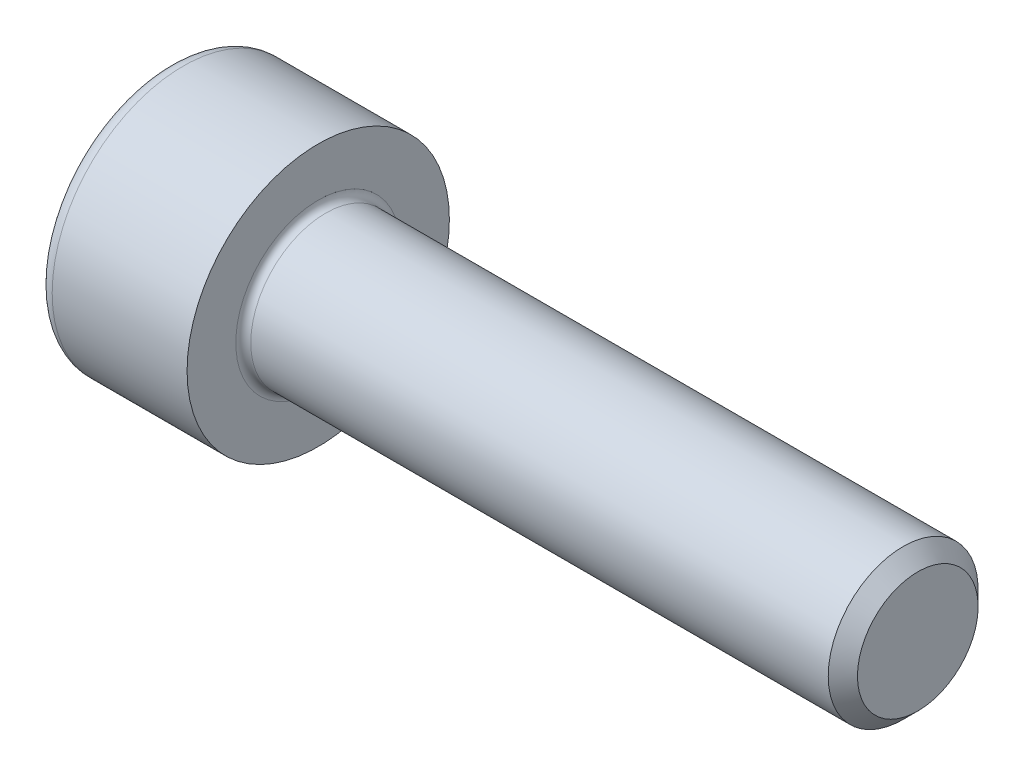
ISO-10303-21;
HEADER;
FILE_DESCRIPTION(('STEP AP214'),'2;1');
FILE_NAME('part.step','',(''),(''),'','','');
FILE_SCHEMA(('AUTOMOTIVE_DESIGN { 1 0 10303 214 1 1 1 1 }'));
ENDSEC;
DATA;
#1=APPLICATION_CONTEXT('core data for automotive mechanical design processes');
#2=APPLICATION_PROTOCOL_DEFINITION('international standard','automotive_design',2000,#1);
#3=PRODUCT_CONTEXT('',#1,'mechanical');
#4=PRODUCT('Part','Part','',(#3));
#5=PRODUCT_RELATED_PRODUCT_CATEGORY('part','',(#4));
#6=PRODUCT_DEFINITION_FORMATION('','',#4);
#7=PRODUCT_DEFINITION_CONTEXT('part definition',#1,'design');
#8=PRODUCT_DEFINITION('design','',#6,#7);
#9=PRODUCT_DEFINITION_SHAPE('','',#8);
#10=(LENGTH_UNIT() NAMED_UNIT(*) SI_UNIT(.MILLI.,.METRE.));
#11=(NAMED_UNIT(*) PLANE_ANGLE_UNIT() SI_UNIT($,.RADIAN.));
#12=(NAMED_UNIT(*) SI_UNIT($,.STERADIAN.) SOLID_ANGLE_UNIT());
#13=UNCERTAINTY_MEASURE_WITH_UNIT(LENGTH_MEASURE(1.E-05),#10,'distance_accuracy_value','');
#14=(GEOMETRIC_REPRESENTATION_CONTEXT(3) GLOBAL_UNCERTAINTY_ASSIGNED_CONTEXT((#13)) GLOBAL_UNIT_ASSIGNED_CONTEXT((#10,
#11,#12)) REPRESENTATION_CONTEXT('',''));
#15=CARTESIAN_POINT('',(0.,0.,0.));
#16=DIRECTION('',(0.,0.,1.));
#17=DIRECTION('',(1.,0.,0.));
#18=AXIS2_PLACEMENT_3D('',#15,#16,#17);
#19=CARTESIAN_POINT('',(0.,0.,0.));
#20=DIRECTION('',(-1.,0.,0.));
#21=DIRECTION('',(0.,0.,1.));
#22=AXIS2_PLACEMENT_3D('',#19,#20,#21);
#23=PLANE('',#22);
#24=DIRECTION('',(0.,-0.499999999999999,0.866025403784439));
#25=VECTOR('',#24,1.);
#26=CARTESIAN_POINT('',(0.,1.74359781295267,0.));
#27=LINE('',#26,#25);
#28=CARTESIAN_POINT('',(0.,1.74359781295267,0.));
#29=VERTEX_POINT('',#28);
#30=CARTESIAN_POINT('',(0.,0.871798906476336,1.51));
#31=VERTEX_POINT('',#30);
#32=EDGE_CURVE('E265',#29,#31,#27,.T.);
#33=ORIENTED_EDGE('',*,*,#32,.T.);
#34=DIRECTION('',(0.,1.,0.));
#35=VECTOR('',#34,1.);
#36=CARTESIAN_POINT('',(0.,-0.871798906476335,1.51));
#37=LINE('',#36,#35);
#38=CARTESIAN_POINT('',(0.,-0.871798906476335,1.51));
#39=VERTEX_POINT('',#38);
#40=EDGE_CURVE('E137',#39,#31,#37,.T.);
#41=ORIENTED_EDGE('',*,*,#40,.F.);
#42=DIRECTION('',(0.,-0.500000000000001,-0.866025403784438));
#43=VECTOR('',#42,1.);
#44=CARTESIAN_POINT('',(0.,-0.871798906476335,1.51));
#45=LINE('',#44,#43);
#46=CARTESIAN_POINT('',(0.,-1.74359781295267,0.));
#47=VERTEX_POINT('',#46);
#48=EDGE_CURVE('E268',#39,#47,#45,.T.);
#49=ORIENTED_EDGE('',*,*,#48,.T.);
#50=DIRECTION('',(0.,0.499999999999999,-0.866025403784439));
#51=VECTOR('',#50,1.);
#52=CARTESIAN_POINT('',(0.,-1.74359781295267,0.));
#53=LINE('',#52,#51);
#54=CARTESIAN_POINT('',(0.,-0.871798906476338,-1.51));
#55=VERTEX_POINT('',#54);
#56=EDGE_CURVE('E271',#47,#55,#53,.T.);
#57=ORIENTED_EDGE('',*,*,#56,.T.);
#58=DIRECTION('',(0.,-1.,0.));
#59=VECTOR('',#58,1.);
#60=CARTESIAN_POINT('',(0.,0.871798906476332,-1.51));
#61=LINE('',#60,#59);
#62=CARTESIAN_POINT('',(0.,0.871798906476332,-1.51));
#63=VERTEX_POINT('',#62);
#64=EDGE_CURVE('E274',#63,#55,#61,.T.);
#65=ORIENTED_EDGE('',*,*,#64,.F.);
#66=DIRECTION('',(0.,-0.500000000000001,-0.866025403784438));
#67=VECTOR('',#66,1.);
#68=CARTESIAN_POINT('',(0.,1.74359781295267,0.));
#69=LINE('',#68,#67);
#70=EDGE_CURVE('E132',#29,#63,#69,.T.);
#71=ORIENTED_EDGE('',*,*,#70,.F.);
#72=EDGE_LOOP('',(#33,#41,#49,#57,#65,#71));
#73=FACE_BOUND('',#72,.T.);
#74=CARTESIAN_POINT('',(0.,0.,0.));
#75=DIRECTION('',(-1.,0.,0.));
#76=DIRECTION('',(0.,0.,1.));
#77=AXIS2_PLACEMENT_3D('',#74,#75,#76);
#78=CIRCLE('',#77,3.1);
#79=CARTESIAN_POINT('',(0.,0.,3.1));
#80=VERTEX_POINT('',#79);
#81=EDGE_CURVE('E49',#80,#80,#78,.T.);
#82=ORIENTED_EDGE('',*,*,#81,.T.);
#83=EDGE_LOOP('',(#82));
#84=FACE_BOUND('',#83,.T.);
#85=ADVANCED_FACE('F41',(#73,#84),#23,.T.);
#86=CARTESIAN_POINT('',(-31.75,0.,0.));
#87=DIRECTION('',(-1.,0.,0.));
#88=DIRECTION('',(0.,0.,1.));
#89=AXIS2_PLACEMENT_3D('',#86,#87,#88);
#90=CYLINDRICAL_SURFACE('',#89,3.5);
#91=CARTESIAN_POINT('',(0.399999999999998,0.,0.));
#92=DIRECTION('',(-1.,0.,0.));
#93=DIRECTION('',(0.,0.,1.));
#94=AXIS2_PLACEMENT_3D('',#91,#92,#93);
#95=CIRCLE('',#94,3.5);
#96=CARTESIAN_POINT('',(0.399999999999998,0.,3.5));
#97=VERTEX_POINT('',#96);
#98=EDGE_CURVE('E11',#97,#97,#95,.F.);
#99=ORIENTED_EDGE('',*,*,#98,.T.);
#100=EDGE_LOOP('',(#99));
#101=FACE_BOUND('',#100,.T.);
#102=CARTESIAN_POINT('',(4.,0.,0.));
#103=DIRECTION('',(-1.,0.,0.));
#104=DIRECTION('',(0.,0.,1.));
#105=AXIS2_PLACEMENT_3D('',#102,#103,#104);
#106=CIRCLE('',#105,3.5);
#107=CARTESIAN_POINT('',(4.,0.,3.5));
#108=VERTEX_POINT('',#107);
#109=EDGE_CURVE('E155',#108,#108,#106,.T.);
#110=ORIENTED_EDGE('',*,*,#109,.T.);
#111=EDGE_LOOP('',(#110));
#112=FACE_BOUND('',#111,.T.);
#113=ADVANCED_FACE('F180',(#101,#112),#90,.T.);
#114=CARTESIAN_POINT('',(4.,3.5,0.));
#115=DIRECTION('',(1.,0.,0.));
#116=DIRECTION('',(0.,0.,-1.));
#117=AXIS2_PLACEMENT_3D('',#114,#115,#116);
#118=PLANE('',#117);
#119=CARTESIAN_POINT('',(4.,0.,0.));
#120=DIRECTION('',(1.,0.,0.));
#121=DIRECTION('',(0.,0.,-1.));
#122=AXIS2_PLACEMENT_3D('',#119,#120,#121);
#123=CIRCLE('',#122,2.2);
#124=CARTESIAN_POINT('',(4.,0.,-2.2));
#125=VERTEX_POINT('',#124);
#126=EDGE_CURVE('E158',#125,#125,#123,.F.);
#127=ORIENTED_EDGE('',*,*,#126,.T.);
#128=EDGE_LOOP('',(#127));
#129=FACE_BOUND('',#128,.T.);
#130=ORIENTED_EDGE('',*,*,#109,.F.);
#131=EDGE_LOOP('',(#130));
#132=FACE_BOUND('',#131,.T.);
#133=ADVANCED_FACE('F185',(#129,#132),#118,.T.);
#134=CARTESIAN_POINT('',(-31.75,0.,0.));
#135=DIRECTION('',(-1.,0.,0.));
#136=DIRECTION('',(0.,0.,1.));
#137=AXIS2_PLACEMENT_3D('',#134,#135,#136);
#138=CYLINDRICAL_SURFACE('',#137,2.);
#139=CARTESIAN_POINT('',(4.2,0.,0.));
#140=DIRECTION('',(1.,0.,0.));
#141=DIRECTION('',(0.,0.,-1.));
#142=AXIS2_PLACEMENT_3D('',#139,#140,#141);
#143=CIRCLE('',#142,2.);
#144=CARTESIAN_POINT('',(4.2,0.,-2.));
#145=VERTEX_POINT('',#144);
#146=EDGE_CURVE('E161',#145,#145,#143,.T.);
#147=ORIENTED_EDGE('',*,*,#146,.T.);
#148=EDGE_LOOP('',(#147));
#149=FACE_BOUND('',#148,.T.);
#150=CARTESIAN_POINT('',(19.61,0.,0.));
#151=DIRECTION('',(-1.,0.,0.));
#152=DIRECTION('',(0.,0.,1.));
#153=AXIS2_PLACEMENT_3D('',#150,#151,#152);
#154=CIRCLE('',#153,2.);
#155=CARTESIAN_POINT('',(19.61,0.,2.));
#156=VERTEX_POINT('',#155);
#157=EDGE_CURVE('E152',#156,#156,#154,.T.);
#158=ORIENTED_EDGE('',*,*,#157,.T.);
#159=EDGE_LOOP('',(#158));
#160=FACE_BOUND('',#159,.T.);
#161=ADVANCED_FACE('F191',(#149,#160),#138,.T.);
#162=CARTESIAN_POINT('',(20.,0.,0.));
#163=DIRECTION('',(-1.,0.,0.));
#164=DIRECTION('',(0.,0.,1.));
#165=AXIS2_PLACEMENT_3D('',#162,#163,#164);
#166=CONICAL_SURFACE('',#165,1.61,0.785398163397445);
#167=ORIENTED_EDGE('',*,*,#157,.F.);
#168=EDGE_LOOP('',(#167));
#169=FACE_BOUND('',#168,.T.);
#170=CARTESIAN_POINT('',(20.,0.,0.));
#171=DIRECTION('',(-1.,0.,0.));
#172=DIRECTION('',(0.,0.,1.));
#173=AXIS2_PLACEMENT_3D('',#170,#171,#172);
#174=CIRCLE('',#173,1.61);
#175=CARTESIAN_POINT('',(20.,0.,1.61));
#176=VERTEX_POINT('',#175);
#177=EDGE_CURVE('E148',#176,#176,#174,.T.);
#178=ORIENTED_EDGE('',*,*,#177,.T.);
#179=EDGE_LOOP('',(#178));
#180=FACE_BOUND('',#179,.T.);
#181=ADVANCED_FACE('F195',(#169,#180),#166,.T.);
#182=CARTESIAN_POINT('',(20.,1.61,0.));
#183=DIRECTION('',(1.,0.,0.));
#184=DIRECTION('',(0.,0.,-1.));
#185=AXIS2_PLACEMENT_3D('',#182,#183,#184);
#186=PLANE('',#185);
#187=ORIENTED_EDGE('',*,*,#177,.F.);
#188=EDGE_LOOP('',(#187));
#189=FACE_BOUND('',#188,.T.);
#190=ADVANCED_FACE('F177',(#189),#186,.T.);
#191=CARTESIAN_POINT('',(4.2,0.,0.));
#192=DIRECTION('',(1.,0.,0.));
#193=DIRECTION('',(0.,0.,-1.));
#194=AXIS2_PLACEMENT_3D('',#191,#192,#193);
#195=TOROIDAL_SURFACE('',#194,2.2,0.2);
#196=ORIENTED_EDGE('',*,*,#146,.F.);
#197=EDGE_LOOP('',(#196));
#198=FACE_BOUND('',#197,.T.);
#199=ORIENTED_EDGE('',*,*,#126,.F.);
#200=EDGE_LOOP('',(#199));
#201=FACE_BOUND('',#200,.T.);
#202=ADVANCED_FACE('F168',(#198,#201),#195,.F.);
#203=CARTESIAN_POINT('',(0.399999999999998,0.,0.));
#204=DIRECTION('',(-1.,0.,0.));
#205=DIRECTION('',(0.,0.,1.));
#206=AXIS2_PLACEMENT_3D('',#203,#204,#205);
#207=TOROIDAL_SURFACE('',#206,3.1,0.4);
#208=ORIENTED_EDGE('',*,*,#98,.F.);
#209=EDGE_LOOP('',(#208));
#210=FACE_BOUND('',#209,.T.);
#211=ORIENTED_EDGE('',*,*,#81,.F.);
#212=EDGE_LOOP('',(#211));
#213=FACE_BOUND('',#212,.T.);
#214=ADVANCED_FACE('F43',(#210,#213),#207,.T.);
#215=CARTESIAN_POINT('',(2.,1.74359781295267,0.));
#216=DIRECTION('',(0.,-0.866025403784439,-0.499999999999999));
#217=DIRECTION('',(0.,0.5,-0.866025403784439));
#218=AXIS2_PLACEMENT_3D('',#215,#216,#217);
#219=PLANE('',#218);
#220=ORIENTED_EDGE('',*,*,#32,.F.);
#221=DIRECTION('',(-1.,0.,0.));
#222=VECTOR('',#221,1.);
#223=CARTESIAN_POINT('',(2.,1.74359781295267,0.));
#224=LINE('',#223,#222);
#225=CARTESIAN_POINT('',(2.,1.74359781295267,0.));
#226=VERTEX_POINT('',#225);
#227=EDGE_CURVE('E255',#226,#29,#224,.T.);
#228=ORIENTED_EDGE('',*,*,#227,.F.);
#229=DIRECTION('',(0.,-0.499999999999999,0.866025403784439));
#230=VECTOR('',#229,1.);
#231=CARTESIAN_POINT('',(2.,1.74359781295267,0.));
#232=LINE('',#231,#230);
#233=CARTESIAN_POINT('',(2.,1.3076983597145,0.754999999999999));
#234=VERTEX_POINT('',#233);
#235=EDGE_CURVE('E124',#226,#234,#232,.T.);
#236=ORIENTED_EDGE('',*,*,#235,.T.);
#237=CARTESIAN_POINT('',(2.,0.871798906476336,1.51));
#238=VERTEX_POINT('',#237);
#239=EDGE_CURVE('E115',#234,#238,#232,.T.);
#240=ORIENTED_EDGE('',*,*,#239,.T.);
#241=DIRECTION('',(-1.,0.,0.));
#242=VECTOR('',#241,1.);
#243=CARTESIAN_POINT('',(2.,0.871798906476336,1.51));
#244=LINE('',#243,#242);
#245=EDGE_CURVE('E129',#238,#31,#244,.T.);
#246=ORIENTED_EDGE('',*,*,#245,.T.);
#247=EDGE_LOOP('',(#220,#228,#236,#240,#246));
#248=FACE_BOUND('',#247,.T.);
#249=ADVANCED_FACE('F128',(#248),#219,.T.);
#250=CARTESIAN_POINT('',(2.,-0.871798906476335,1.51));
#251=DIRECTION('',(0.,0.,1.));
#252=DIRECTION('',(0.,-1.,0.));
#253=AXIS2_PLACEMENT_3D('',#250,#251,#252);
#254=PLANE('',#253);
#255=ORIENTED_EDGE('',*,*,#40,.T.);
#256=ORIENTED_EDGE('',*,*,#245,.F.);
#257=DIRECTION('',(0.,1.,0.));
#258=VECTOR('',#257,1.);
#259=CARTESIAN_POINT('',(2.,-0.871798906476335,1.51));
#260=LINE('',#259,#258);
#261=CARTESIAN_POINT('',(2.,0.,1.51));
#262=VERTEX_POINT('',#261);
#263=EDGE_CURVE('E112',#262,#238,#260,.T.);
#264=ORIENTED_EDGE('',*,*,#263,.F.);
#265=CARTESIAN_POINT('',(2.,-0.871798906476335,1.51));
#266=VERTEX_POINT('',#265);
#267=EDGE_CURVE('E123',#266,#262,#260,.T.);
#268=ORIENTED_EDGE('',*,*,#267,.F.);
#269=DIRECTION('',(-1.,0.,0.));
#270=VECTOR('',#269,1.);
#271=CARTESIAN_POINT('',(2.,-0.871798906476335,1.51));
#272=LINE('',#271,#270);
#273=EDGE_CURVE('E139',#266,#39,#272,.T.);
#274=ORIENTED_EDGE('',*,*,#273,.T.);
#275=EDGE_LOOP('',(#255,#256,#264,#268,#274));
#276=FACE_BOUND('',#275,.T.);
#277=ADVANCED_FACE('F134',(#276),#254,.F.);
#278=CARTESIAN_POINT('',(2.,-0.871798906476335,1.51));
#279=DIRECTION('',(0.,0.866025403784438,-0.500000000000001));
#280=DIRECTION('',(0.,0.500000000000001,0.866025403784438));
#281=AXIS2_PLACEMENT_3D('',#278,#279,#280);
#282=PLANE('',#281);
#283=ORIENTED_EDGE('',*,*,#48,.F.);
#284=ORIENTED_EDGE('',*,*,#273,.F.);
#285=DIRECTION('',(0.,-0.500000000000001,-0.866025403784438));
#286=VECTOR('',#285,1.);
#287=CARTESIAN_POINT('',(2.,-0.871798906476335,1.51));
#288=LINE('',#287,#286);
#289=CARTESIAN_POINT('',(2.,-1.3076983597145,0.755000000000002));
#290=VERTEX_POINT('',#289);
#291=EDGE_CURVE('E294',#266,#290,#288,.T.);
#292=ORIENTED_EDGE('',*,*,#291,.T.);
#293=CARTESIAN_POINT('',(2.,-1.74359781295267,0.));
#294=VERTEX_POINT('',#293);
#295=EDGE_CURVE('E283',#290,#294,#288,.T.);
#296=ORIENTED_EDGE('',*,*,#295,.T.);
#297=DIRECTION('',(-1.,0.,0.));
#298=VECTOR('',#297,1.);
#299=CARTESIAN_POINT('',(2.,-1.74359781295267,0.));
#300=LINE('',#299,#298);
#301=EDGE_CURVE('E144',#294,#47,#300,.T.);
#302=ORIENTED_EDGE('',*,*,#301,.T.);
#303=EDGE_LOOP('',(#283,#284,#292,#296,#302));
#304=FACE_BOUND('',#303,.T.);
#305=ADVANCED_FACE('F209',(#304),#282,.T.);
#306=CARTESIAN_POINT('',(2.,-1.74359781295267,0.));
#307=DIRECTION('',(0.,0.866025403784439,0.499999999999999));
#308=DIRECTION('',(0.,-0.499999999999999,0.866025403784439));
#309=AXIS2_PLACEMENT_3D('',#306,#307,#308);
#310=PLANE('',#309);
#311=ORIENTED_EDGE('',*,*,#56,.F.);
#312=ORIENTED_EDGE('',*,*,#301,.F.);
#313=DIRECTION('',(0.,0.499999999999999,-0.866025403784439));
#314=VECTOR('',#313,1.);
#315=CARTESIAN_POINT('',(2.,-1.74359781295267,0.));
#316=LINE('',#315,#314);
#317=CARTESIAN_POINT('',(2.,-1.3076983597145,-0.754999999999999));
#318=VERTEX_POINT('',#317);
#319=EDGE_CURVE('E261',#294,#318,#316,.T.);
#320=ORIENTED_EDGE('',*,*,#319,.T.);
#321=CARTESIAN_POINT('',(2.,-0.871798906476338,-1.51));
#322=VERTEX_POINT('',#321);
#323=EDGE_CURVE('E293',#318,#322,#316,.T.);
#324=ORIENTED_EDGE('',*,*,#323,.T.);
#325=DIRECTION('',(-1.,0.,0.));
#326=VECTOR('',#325,1.);
#327=CARTESIAN_POINT('',(2.,-0.871798906476338,-1.51));
#328=LINE('',#327,#326);
#329=EDGE_CURVE('E254',#322,#55,#328,.T.);
#330=ORIENTED_EDGE('',*,*,#329,.T.);
#331=EDGE_LOOP('',(#311,#312,#320,#324,#330));
#332=FACE_BOUND('',#331,.T.);
#333=ADVANCED_FACE('F212',(#332),#310,.T.);
#334=CARTESIAN_POINT('',(2.,0.871798906476332,-1.51));
#335=DIRECTION('',(0.,0.,-1.));
#336=DIRECTION('',(0.,1.,0.));
#337=AXIS2_PLACEMENT_3D('',#334,#335,#336);
#338=PLANE('',#337);
#339=ORIENTED_EDGE('',*,*,#64,.T.);
#340=ORIENTED_EDGE('',*,*,#329,.F.);
#341=DIRECTION('',(0.,-1.,0.));
#342=VECTOR('',#341,1.);
#343=CARTESIAN_POINT('',(2.,0.871798906476332,-1.51));
#344=LINE('',#343,#342);
#345=CARTESIAN_POINT('',(2.,0.,-1.51));
#346=VERTEX_POINT('',#345);
#347=EDGE_CURVE('E258',#346,#322,#344,.T.);
#348=ORIENTED_EDGE('',*,*,#347,.F.);
#349=CARTESIAN_POINT('',(2.,0.871798906476332,-1.51));
#350=VERTEX_POINT('',#349);
#351=EDGE_CURVE('E56',#350,#346,#344,.T.);
#352=ORIENTED_EDGE('',*,*,#351,.F.);
#353=DIRECTION('',(-1.,0.,0.));
#354=VECTOR('',#353,1.);
#355=CARTESIAN_POINT('',(2.,0.871798906476332,-1.51));
#356=LINE('',#355,#354);
#357=EDGE_CURVE('E251',#350,#63,#356,.T.);
#358=ORIENTED_EDGE('',*,*,#357,.T.);
#359=EDGE_LOOP('',(#339,#340,#348,#352,#358));
#360=FACE_BOUND('',#359,.T.);
#361=ADVANCED_FACE('F216',(#360),#338,.F.);
#362=CARTESIAN_POINT('',(2.,1.74359781295267,0.));
#363=DIRECTION('',(0.,0.866025403784438,-0.500000000000001));
#364=DIRECTION('',(0.,0.500000000000001,0.866025403784438));
#365=AXIS2_PLACEMENT_3D('',#362,#363,#364);
#366=PLANE('',#365);
#367=ORIENTED_EDGE('',*,*,#70,.T.);
#368=ORIENTED_EDGE('',*,*,#357,.F.);
#369=DIRECTION('',(0.,-0.500000000000001,-0.866025403784438));
#370=VECTOR('',#369,1.);
#371=CARTESIAN_POINT('',(2.,1.74359781295267,0.));
#372=LINE('',#371,#370);
#373=CARTESIAN_POINT('',(2.,1.3076983597145,-0.755000000000002));
#374=VERTEX_POINT('',#373);
#375=EDGE_CURVE('E241',#374,#350,#372,.T.);
#376=ORIENTED_EDGE('',*,*,#375,.F.);
#377=EDGE_CURVE('E247',#226,#374,#372,.T.);
#378=ORIENTED_EDGE('',*,*,#377,.F.);
#379=ORIENTED_EDGE('',*,*,#227,.T.);
#380=EDGE_LOOP('',(#367,#368,#376,#378,#379));
#381=FACE_BOUND('',#380,.T.);
#382=ADVANCED_FACE('F220',(#381),#366,.F.);
#383=CARTESIAN_POINT('',(2.,1.74359781295267,0.));
#384=DIRECTION('',(1.,0.,0.));
#385=DIRECTION('',(0.,0.,-1.));
#386=AXIS2_PLACEMENT_3D('',#383,#384,#385);
#387=PLANE('',#386);
#388=ORIENTED_EDGE('',*,*,#347,.T.);
#389=ORIENTED_EDGE('',*,*,#323,.F.);
#390=CARTESIAN_POINT('',(2.,0.,0.));
#391=DIRECTION('',(-1.,0.,0.));
#392=DIRECTION('',(0.,0.,1.));
#393=AXIS2_PLACEMENT_3D('',#390,#391,#392);
#394=CIRCLE('',#393,1.51);
#395=EDGE_CURVE('E289',#346,#318,#394,.T.);
#396=ORIENTED_EDGE('',*,*,#395,.F.);
#397=EDGE_LOOP('',(#388,#389,#396));
#398=FACE_BOUND('',#397,.T.);
#399=ADVANCED_FACE('F224',(#398),#387,.F.);
#400=ORIENTED_EDGE('',*,*,#319,.F.);
#401=ORIENTED_EDGE('',*,*,#295,.F.);
#402=EDGE_CURVE('E142',#318,#290,#394,.T.);
#403=ORIENTED_EDGE('',*,*,#402,.F.);
#404=EDGE_LOOP('',(#400,#401,#403));
#405=FACE_BOUND('',#404,.T.);
#406=ADVANCED_FACE('F227',(#405),#387,.F.);
#407=ORIENTED_EDGE('',*,*,#291,.F.);
#408=ORIENTED_EDGE('',*,*,#267,.T.);
#409=EDGE_CURVE('E138',#290,#262,#394,.T.);
#410=ORIENTED_EDGE('',*,*,#409,.F.);
#411=EDGE_LOOP('',(#407,#408,#410));
#412=FACE_BOUND('',#411,.T.);
#413=ADVANCED_FACE('F232',(#412),#387,.F.);
#414=ORIENTED_EDGE('',*,*,#263,.T.);
#415=ORIENTED_EDGE('',*,*,#239,.F.);
#416=EDGE_CURVE('E118',#262,#234,#394,.T.);
#417=ORIENTED_EDGE('',*,*,#416,.F.);
#418=EDGE_LOOP('',(#414,#415,#417));
#419=FACE_BOUND('',#418,.T.);
#420=ADVANCED_FACE('F114',(#419),#387,.F.);
#421=ORIENTED_EDGE('',*,*,#235,.F.);
#422=ORIENTED_EDGE('',*,*,#377,.T.);
#423=EDGE_CURVE('E149',#234,#374,#394,.T.);
#424=ORIENTED_EDGE('',*,*,#423,.F.);
#425=EDGE_LOOP('',(#421,#422,#424));
#426=FACE_BOUND('',#425,.T.);
#427=ADVANCED_FACE('F235',(#426),#387,.F.);
#428=ORIENTED_EDGE('',*,*,#375,.T.);
#429=ORIENTED_EDGE('',*,*,#351,.T.);
#430=EDGE_CURVE('E244',#374,#346,#394,.T.);
#431=ORIENTED_EDGE('',*,*,#430,.F.);
#432=EDGE_LOOP('',(#428,#429,#431));
#433=FACE_BOUND('',#432,.T.);
#434=ADVANCED_FACE('F205',(#433),#387,.F.);
#435=CARTESIAN_POINT('',(2.,0.,0.));
#436=DIRECTION('',(-1.,0.,0.));
#437=DIRECTION('',(0.,0.,1.));
#438=AXIS2_PLACEMENT_3D('',#435,#436,#437);
#439=CONICAL_SURFACE('',#438,1.51,1.04719755119659);
#440=CARTESIAN_POINT('',(2.87179890647635,0.,0.));
#441=VERTEX_POINT('',#440);
#442=VERTEX_LOOP('',#441);
#443=FACE_BOUND('',#442,.T.);
#444=ORIENTED_EDGE('',*,*,#416,.T.);
#445=ORIENTED_EDGE('',*,*,#423,.T.);
#446=ORIENTED_EDGE('',*,*,#430,.T.);
#447=ORIENTED_EDGE('',*,*,#395,.T.);
#448=ORIENTED_EDGE('',*,*,#402,.T.);
#449=ORIENTED_EDGE('',*,*,#409,.T.);
#450=EDGE_LOOP('',(#444,#445,#446,#447,#448,#449));
#451=FACE_BOUND('',#450,.T.);
#452=ADVANCED_FACE('F203',(#443,#451),#439,.F.);
#453=CLOSED_SHELL('',(#85,#113,#133,#161,#181,#190,#202,#214,#249,#277,#305,#333,#361,#382,#399,
#406,#413,#420,#427,#434,#452));
#454=MANIFOLD_SOLID_BREP('B2',#453);
#455=ADVANCED_BREP_SHAPE_REPRESENTATION('',(#18,#454),#14);
#456=SHAPE_DEFINITION_REPRESENTATION(#9,#455);
ENDSEC;
END-ISO-10303-21;
